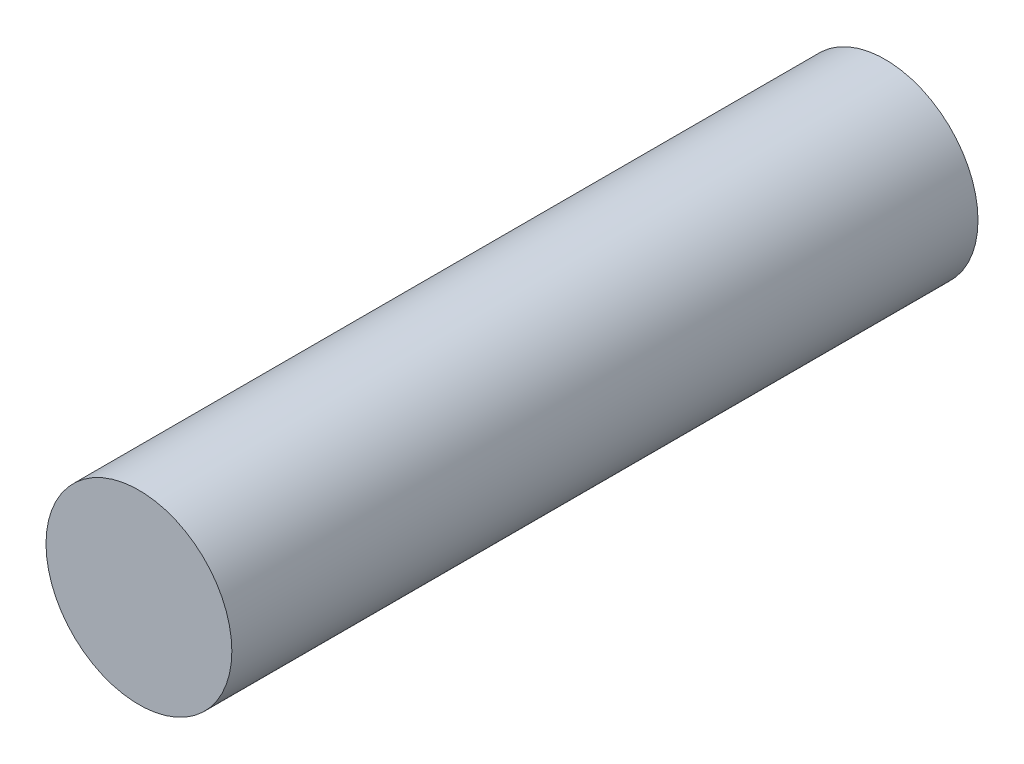
ISO-10303-21;
HEADER;
FILE_DESCRIPTION(('STEP AP214'),'2;1');
FILE_NAME('part.step','',(''),(''),'','','');
FILE_SCHEMA(('AUTOMOTIVE_DESIGN { 1 0 10303 214 1 1 1 1 }'));
ENDSEC;
DATA;
#1=APPLICATION_CONTEXT('core data for automotive mechanical design processes');
#2=APPLICATION_PROTOCOL_DEFINITION('international standard','automotive_design',2000,#1);
#3=PRODUCT_CONTEXT('',#1,'mechanical');
#4=PRODUCT('Part','Part','',(#3));
#5=PRODUCT_RELATED_PRODUCT_CATEGORY('part','',(#4));
#6=PRODUCT_DEFINITION_FORMATION('','',#4);
#7=PRODUCT_DEFINITION_CONTEXT('part definition',#1,'design');
#8=PRODUCT_DEFINITION('design','',#6,#7);
#9=PRODUCT_DEFINITION_SHAPE('','',#8);
#10=(LENGTH_UNIT() NAMED_UNIT(*) SI_UNIT(.MILLI.,.METRE.));
#11=(NAMED_UNIT(*) PLANE_ANGLE_UNIT() SI_UNIT($,.RADIAN.));
#12=(NAMED_UNIT(*) SI_UNIT($,.STERADIAN.) SOLID_ANGLE_UNIT());
#13=UNCERTAINTY_MEASURE_WITH_UNIT(LENGTH_MEASURE(1.E-05),#10,'distance_accuracy_value','');
#14=(GEOMETRIC_REPRESENTATION_CONTEXT(3) GLOBAL_UNCERTAINTY_ASSIGNED_CONTEXT((#13)) GLOBAL_UNIT_ASSIGNED_CONTEXT((#10,
#11,#12)) REPRESENTATION_CONTEXT('',''));
#15=CARTESIAN_POINT('',(0.,0.,0.));
#16=DIRECTION('',(0.,0.,1.));
#17=DIRECTION('',(1.,0.,0.));
#18=AXIS2_PLACEMENT_3D('',#15,#16,#17);
#19=CARTESIAN_POINT('',(0.,0.,199.75));
#20=DIRECTION('',(0.,0.,-1.));
#21=DIRECTION('',(-1.,0.,0.));
#22=AXIS2_PLACEMENT_3D('',#19,#20,#21);
#23=CYLINDRICAL_SURFACE('',#22,24.875);
#24=CARTESIAN_POINT('',(0.,0.,199.75));
#25=DIRECTION('',(0.,0.,1.));
#26=DIRECTION('',(1.,0.,0.));
#27=AXIS2_PLACEMENT_3D('',#24,#25,#26);
#28=CIRCLE('',#27,24.875);
#29=CARTESIAN_POINT('',(24.875,0.,199.75));
#30=VERTEX_POINT('',#29);
#31=EDGE_CURVE('E10',#30,#30,#28,.T.);
#32=ORIENTED_EDGE('',*,*,#31,.F.);
#33=EDGE_LOOP('',(#32));
#34=FACE_BOUND('',#33,.T.);
#35=CARTESIAN_POINT('',(0.,0.,0.));
#36=DIRECTION('',(0.,0.,1.));
#37=DIRECTION('',(1.,0.,0.));
#38=AXIS2_PLACEMENT_3D('',#35,#36,#37);
#39=CIRCLE('',#38,24.875);
#40=CARTESIAN_POINT('',(24.875,0.,0.));
#41=VERTEX_POINT('',#40);
#42=EDGE_CURVE('E36',#41,#41,#39,.T.);
#43=ORIENTED_EDGE('',*,*,#42,.T.);
#44=EDGE_LOOP('',(#43));
#45=FACE_BOUND('',#44,.T.);
#46=ADVANCED_FACE('F33',(#34,#45),#23,.T.);
#47=CARTESIAN_POINT('',(0.,0.,199.75));
#48=DIRECTION('',(0.,0.,1.));
#49=DIRECTION('',(1.,0.,0.));
#50=AXIS2_PLACEMENT_3D('',#47,#48,#49);
#51=PLANE('',#50);
#52=ORIENTED_EDGE('',*,*,#31,.T.);
#53=EDGE_LOOP('',(#52));
#54=FACE_BOUND('',#53,.T.);
#55=ADVANCED_FACE('F48',(#54),#51,.T.);
#56=CARTESIAN_POINT('',(0.,0.,0.));
#57=DIRECTION('',(0.,0.,1.));
#58=DIRECTION('',(1.,0.,0.));
#59=AXIS2_PLACEMENT_3D('',#56,#57,#58);
#60=PLANE('',#59);
#61=ORIENTED_EDGE('',*,*,#42,.F.);
#62=EDGE_LOOP('',(#61));
#63=FACE_BOUND('',#62,.T.);
#64=ADVANCED_FACE('F46',(#63),#60,.F.);
#65=CLOSED_SHELL('',(#46,#55,#64));
#66=MANIFOLD_SOLID_BREP('B2',#65);
#67=ADVANCED_BREP_SHAPE_REPRESENTATION('',(#18,#66),#14);
#68=SHAPE_DEFINITION_REPRESENTATION(#9,#67);
ENDSEC;
END-ISO-10303-21;
